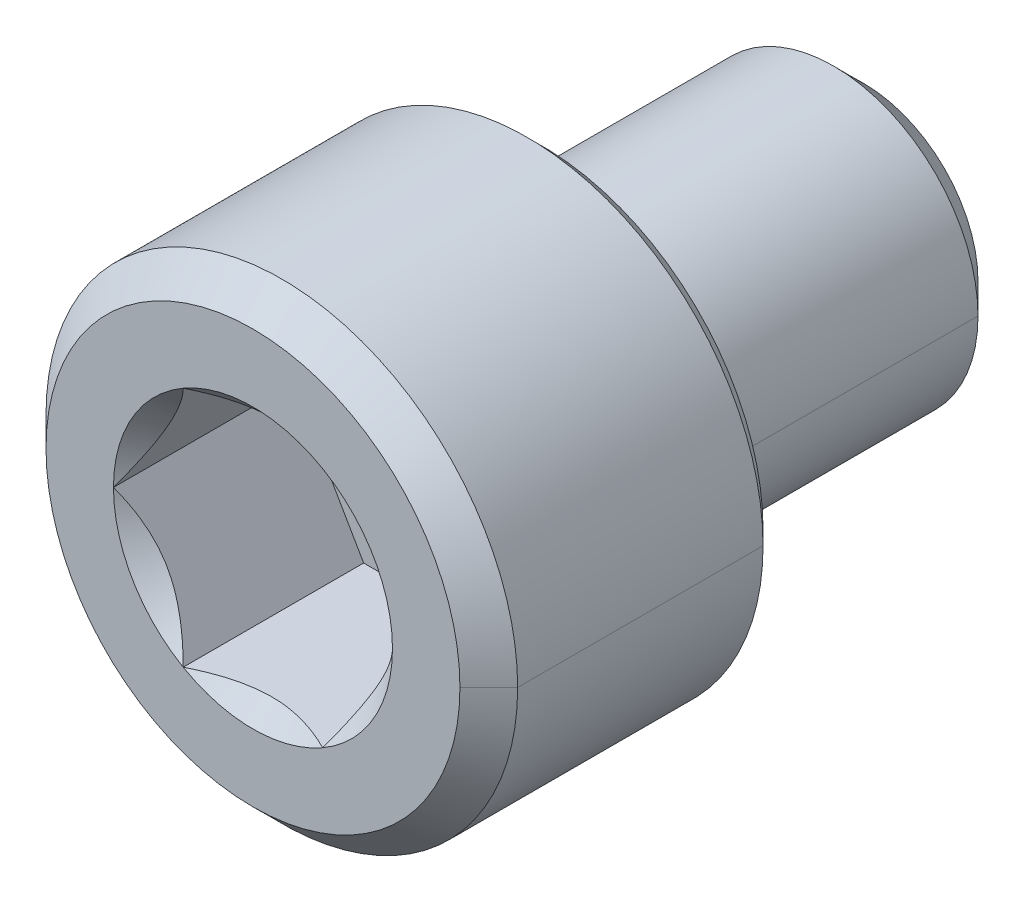
ISO-10303-21;
HEADER;
FILE_DESCRIPTION(('STEP AP214'),'2;1');
FILE_NAME('part.step','',(''),(''),'','','');
FILE_SCHEMA(('AUTOMOTIVE_DESIGN { 1 0 10303 214 1 1 1 1 }'));
ENDSEC;
DATA;
#1=APPLICATION_CONTEXT('core data for automotive mechanical design processes');
#2=APPLICATION_PROTOCOL_DEFINITION('international standard','automotive_design',2000,#1);
#3=PRODUCT_CONTEXT('',#1,'mechanical');
#4=PRODUCT('Part','Part','',(#3));
#5=PRODUCT_RELATED_PRODUCT_CATEGORY('part','',(#4));
#6=PRODUCT_DEFINITION_FORMATION('','',#4);
#7=PRODUCT_DEFINITION_CONTEXT('part definition',#1,'design');
#8=PRODUCT_DEFINITION('design','',#6,#7);
#9=PRODUCT_DEFINITION_SHAPE('','',#8);
#10=(LENGTH_UNIT() NAMED_UNIT(*) SI_UNIT(.MILLI.,.METRE.));
#11=(NAMED_UNIT(*) PLANE_ANGLE_UNIT() SI_UNIT($,.RADIAN.));
#12=(NAMED_UNIT(*) SI_UNIT($,.STERADIAN.) SOLID_ANGLE_UNIT());
#13=UNCERTAINTY_MEASURE_WITH_UNIT(LENGTH_MEASURE(1.E-05),#10,'distance_accuracy_value','');
#14=(GEOMETRIC_REPRESENTATION_CONTEXT(3) GLOBAL_UNCERTAINTY_ASSIGNED_CONTEXT((#13)) GLOBAL_UNIT_ASSIGNED_CONTEXT((#10,
#11,#12)) REPRESENTATION_CONTEXT('',''));
#15=CARTESIAN_POINT('',(0.,0.,0.));
#16=DIRECTION('',(0.,0.,1.));
#17=DIRECTION('',(1.,0.,0.));
#18=AXIS2_PLACEMENT_3D('',#15,#16,#17);
#19=CARTESIAN_POINT('',(0.,0.,3.31724));
#20=DIRECTION('',(0.,0.,1.));
#21=DIRECTION('',(1.,0.,0.));
#22=AXIS2_PLACEMENT_3D('',#19,#20,#21);
#23=CONICAL_SURFACE('',#22,2.3241,0.785398163397447);
#24=CARTESIAN_POINT('',(0.,0.,3.175));
#25=DIRECTION('',(0.,0.,-1.));
#26=DIRECTION('',(1.,0.,0.));
#27=AXIS2_PLACEMENT_3D('',#24,#25,#26);
#28=CIRCLE('',#27,2.18186);
#29=CARTESIAN_POINT('',(-2.18185999999994,0.,3.175));
#30=VERTEX_POINT('',#29);
#31=CARTESIAN_POINT('',(2.18186000000005,0.,3.175));
#32=VERTEX_POINT('',#31);
#33=EDGE_CURVE('E43',#30,#32,#28,.T.);
#34=ORIENTED_EDGE('',*,*,#33,.F.);
#35=DIRECTION('',(-0.707106781186547,0.,0.707106781186548));
#36=VECTOR('',#35,1.);
#37=CARTESIAN_POINT('',(-2.32409999999994,0.,3.31724));
#38=LINE('',#37,#36);
#39=CARTESIAN_POINT('',(-2.32409999999994,0.,3.31724));
#40=VERTEX_POINT('',#39);
#41=EDGE_CURVE('E11',#30,#40,#38,.T.);
#42=ORIENTED_EDGE('',*,*,#41,.T.);
#43=CARTESIAN_POINT('',(0.,0.,3.31724));
#44=DIRECTION('',(0.,0.,1.));
#45=DIRECTION('',(1.,0.,0.));
#46=AXIS2_PLACEMENT_3D('',#43,#44,#45);
#47=CIRCLE('',#46,2.3241);
#48=CARTESIAN_POINT('',(2.32410000000006,0.,3.31724));
#49=VERTEX_POINT('',#48);
#50=EDGE_CURVE('E319',#49,#40,#47,.T.);
#51=ORIENTED_EDGE('',*,*,#50,.F.);
#52=DIRECTION('',(0.707106781186547,0.,0.707106781186548));
#53=VECTOR('',#52,1.);
#54=CARTESIAN_POINT('',(2.32410000000006,0.,3.31724));
#55=LINE('',#54,#53);
#56=EDGE_CURVE('E189',#32,#49,#55,.T.);
#57=ORIENTED_EDGE('',*,*,#56,.F.);
#58=EDGE_LOOP('',(#34,#42,#51,#57));
#59=FACE_BOUND('',#58,.T.);
#60=ADVANCED_FACE('F16',(#59),#23,.T.);
#61=CARTESIAN_POINT('',(0.,0.,6.0198));
#62=DIRECTION('',(0.,0.,-1.));
#63=DIRECTION('',(-1.,0.,0.));
#64=AXIS2_PLACEMENT_3D('',#61,#62,#63);
#65=CONICAL_SURFACE('',#64,2.03962,0.785398163397445);
#66=CARTESIAN_POINT('',(0.,0.,6.0198));
#67=DIRECTION('',(0.,0.,1.));
#68=DIRECTION('',(1.,0.,0.));
#69=AXIS2_PLACEMENT_3D('',#66,#67,#68);
#70=CIRCLE('',#69,2.03962);
#71=CARTESIAN_POINT('',(2.03962000000006,0.,6.0198));
#72=VERTEX_POINT('',#71);
#73=CARTESIAN_POINT('',(-2.03961999999994,0.,6.0198));
#74=VERTEX_POINT('',#73);
#75=EDGE_CURVE('E307',#72,#74,#70,.T.);
#76=ORIENTED_EDGE('',*,*,#75,.F.);
#77=DIRECTION('',(0.707106781186545,0.,-0.70710678118655));
#78=VECTOR('',#77,1.);
#79=CARTESIAN_POINT('',(2.03962000000005,0.,6.0198));
#80=LINE('',#79,#78);
#81=CARTESIAN_POINT('',(2.32410000000006,0.,5.73532));
#82=VERTEX_POINT('',#81);
#83=EDGE_CURVE('E29',#72,#82,#80,.T.);
#84=ORIENTED_EDGE('',*,*,#83,.T.);
#85=CARTESIAN_POINT('',(0.,0.,5.73532));
#86=DIRECTION('',(0.,0.,-1.));
#87=DIRECTION('',(1.,0.,0.));
#88=AXIS2_PLACEMENT_3D('',#85,#86,#87);
#89=CIRCLE('',#88,2.3241);
#90=CARTESIAN_POINT('',(-2.32409999999994,0.,5.73532));
#91=VERTEX_POINT('',#90);
#92=EDGE_CURVE('E289',#91,#82,#89,.T.);
#93=ORIENTED_EDGE('',*,*,#92,.F.);
#94=DIRECTION('',(-0.707106781186545,0.,-0.70710678118655));
#95=VECTOR('',#94,1.);
#96=CARTESIAN_POINT('',(-2.03961999999994,0.,6.0198));
#97=LINE('',#96,#95);
#98=EDGE_CURVE('E303',#74,#91,#97,.T.);
#99=ORIENTED_EDGE('',*,*,#98,.F.);
#100=EDGE_LOOP('',(#76,#84,#93,#99));
#101=FACE_BOUND('',#100,.T.);
#102=ADVANCED_FACE('F250',(#101),#65,.T.);
#103=CARTESIAN_POINT('',(0.,0.,6.0198));
#104=DIRECTION('',(0.,0.,-1.));
#105=DIRECTION('',(-1.,0.,0.));
#106=AXIS2_PLACEMENT_3D('',#103,#104,#105);
#107=CYLINDRICAL_SURFACE('',#106,2.3241);
#108=ORIENTED_EDGE('',*,*,#92,.T.);
#109=DIRECTION('',(0.,0.,-1.));
#110=VECTOR('',#109,1.);
#111=CARTESIAN_POINT('',(2.32410000000006,0.,6.0198));
#112=LINE('',#111,#110);
#113=EDGE_CURVE('E293',#82,#49,#112,.T.);
#114=ORIENTED_EDGE('',*,*,#113,.T.);
#115=ORIENTED_EDGE('',*,*,#50,.T.);
#116=DIRECTION('',(0.,0.,-1.));
#117=VECTOR('',#116,1.);
#118=CARTESIAN_POINT('',(-2.32409999999994,0.,6.0198));
#119=LINE('',#118,#117);
#120=EDGE_CURVE('E294',#91,#40,#119,.T.);
#121=ORIENTED_EDGE('',*,*,#120,.F.);
#122=EDGE_LOOP('',(#108,#114,#115,#121));
#123=FACE_BOUND('',#122,.T.);
#124=ADVANCED_FACE('F271',(#123),#107,.T.);
#125=CARTESIAN_POINT('',(0.,0.,0.297179999999987));
#126=DIRECTION('',(0.,0.,1.));
#127=DIRECTION('',(1.,0.,0.));
#128=AXIS2_PLACEMENT_3D('',#125,#126,#127);
#129=CONICAL_SURFACE('',#128,1.4224,0.78539816339745);
#130=CARTESIAN_POINT('',(0.,0.,0.));
#131=DIRECTION('',(0.,0.,-1.));
#132=DIRECTION('',(1.,0.,0.));
#133=AXIS2_PLACEMENT_3D('',#130,#131,#132);
#134=CIRCLE('',#133,1.12522);
#135=CARTESIAN_POINT('',(-1.12522,0.,0.));
#136=VERTEX_POINT('',#135);
#137=CARTESIAN_POINT('',(1.12522,0.,0.));
#138=VERTEX_POINT('',#137);
#139=EDGE_CURVE('E315',#136,#138,#134,.T.);
#140=ORIENTED_EDGE('',*,*,#139,.F.);
#141=DIRECTION('',(-0.70710678118655,0.,0.707106781186546));
#142=VECTOR('',#141,1.);
#143=CARTESIAN_POINT('',(-1.42240000000003,0.,0.297179999999987));
#144=LINE('',#143,#142);
#145=CARTESIAN_POINT('',(-1.42240000000003,0.,0.297179999999987));
#146=VERTEX_POINT('',#145);
#147=EDGE_CURVE('E323',#136,#146,#144,.T.);
#148=ORIENTED_EDGE('',*,*,#147,.T.);
#149=CARTESIAN_POINT('',(0.,0.,0.297179999999987));
#150=DIRECTION('',(0.,0.,1.));
#151=DIRECTION('',(1.,0.,0.));
#152=AXIS2_PLACEMENT_3D('',#149,#150,#151);
#153=CIRCLE('',#152,1.4224);
#154=CARTESIAN_POINT('',(1.42239999999997,0.,0.297179999999987));
#155=VERTEX_POINT('',#154);
#156=EDGE_CURVE('E329',#155,#146,#153,.T.);
#157=ORIENTED_EDGE('',*,*,#156,.F.);
#158=DIRECTION('',(0.70710678118655,0.,0.707106781186546));
#159=VECTOR('',#158,1.);
#160=CARTESIAN_POINT('',(1.42239999999997,0.,0.297179999999987));
#161=LINE('',#160,#159);
#162=EDGE_CURVE('E312',#138,#155,#161,.T.);
#163=ORIENTED_EDGE('',*,*,#162,.F.);
#164=EDGE_LOOP('',(#140,#148,#157,#163));
#165=FACE_BOUND('',#164,.T.);
#166=ADVANCED_FACE('F276',(#165),#129,.T.);
#167=CARTESIAN_POINT('',(0.,0.,3.175));
#168=DIRECTION('',(0.,0.,-1.));
#169=DIRECTION('',(-1.,0.,0.));
#170=AXIS2_PLACEMENT_3D('',#167,#168,#169);
#171=CYLINDRICAL_SURFACE('',#170,1.4224);
#172=CARTESIAN_POINT('',(0.,0.,3.175));
#173=DIRECTION('',(0.,0.,1.));
#174=DIRECTION('',(1.,0.,0.));
#175=AXIS2_PLACEMENT_3D('',#172,#173,#174);
#176=CIRCLE('',#175,1.4224);
#177=CARTESIAN_POINT('',(1.42240000000006,0.,3.175));
#178=VERTEX_POINT('',#177);
#179=CARTESIAN_POINT('',(-1.42239999999994,0.,3.175));
#180=VERTEX_POINT('',#179);
#181=EDGE_CURVE('E299',#178,#180,#176,.T.);
#182=ORIENTED_EDGE('',*,*,#181,.F.);
#183=DIRECTION('',(0.,0.,-1.));
#184=VECTOR('',#183,1.);
#185=CARTESIAN_POINT('',(1.42240000000006,0.,3.175));
#186=LINE('',#185,#184);
#187=EDGE_CURVE('E333',#178,#155,#186,.T.);
#188=ORIENTED_EDGE('',*,*,#187,.T.);
#189=ORIENTED_EDGE('',*,*,#156,.T.);
#190=DIRECTION('',(0.,0.,-1.));
#191=VECTOR('',#190,1.);
#192=CARTESIAN_POINT('',(-1.42239999999994,0.,3.175));
#193=LINE('',#192,#191);
#194=EDGE_CURVE('E334',#180,#146,#193,.T.);
#195=ORIENTED_EDGE('',*,*,#194,.F.);
#196=EDGE_LOOP('',(#182,#188,#189,#195));
#197=FACE_BOUND('',#196,.T.);
#198=ADVANCED_FACE('F255',(#197),#171,.T.);
#199=CARTESIAN_POINT('',(0.,0.,3.175));
#200=DIRECTION('',(0.,0.,-1.));
#201=DIRECTION('',(-1.,0.,0.));
#202=AXIS2_PLACEMENT_3D('',#199,#200,#201);
#203=CYLINDRICAL_SURFACE('',#202,1.4224);
#204=ORIENTED_EDGE('',*,*,#187,.F.);
#205=CARTESIAN_POINT('',(0.,0.,3.175));
#206=DIRECTION('',(0.,0.,1.));
#207=DIRECTION('',(1.,0.,0.));
#208=AXIS2_PLACEMENT_3D('',#205,#206,#207);
#209=CIRCLE('',#208,1.4224);
#210=EDGE_CURVE('E302',#180,#178,#209,.T.);
#211=ORIENTED_EDGE('',*,*,#210,.F.);
#212=ORIENTED_EDGE('',*,*,#194,.T.);
#213=CARTESIAN_POINT('',(0.,0.,0.297179999999987));
#214=DIRECTION('',(0.,0.,1.));
#215=DIRECTION('',(1.,0.,0.));
#216=AXIS2_PLACEMENT_3D('',#213,#214,#215);
#217=CIRCLE('',#216,1.4224);
#218=EDGE_CURVE('E341',#146,#155,#217,.T.);
#219=ORIENTED_EDGE('',*,*,#218,.T.);
#220=EDGE_LOOP('',(#204,#211,#212,#219));
#221=FACE_BOUND('',#220,.T.);
#222=ADVANCED_FACE('F251',(#221),#203,.T.);
#223=CARTESIAN_POINT('',(0.,0.,0.));
#224=DIRECTION('',(0.,0.,1.));
#225=DIRECTION('',(1.,0.,0.));
#226=AXIS2_PLACEMENT_3D('',#223,#224,#225);
#227=PLANE('',#226);
#228=CARTESIAN_POINT('',(0.,0.,0.));
#229=DIRECTION('',(0.,0.,-1.));
#230=DIRECTION('',(1.,0.,0.));
#231=AXIS2_PLACEMENT_3D('',#228,#229,#230);
#232=CIRCLE('',#231,1.12522);
#233=EDGE_CURVE('E345',#138,#136,#232,.T.);
#234=ORIENTED_EDGE('',*,*,#233,.T.);
#235=ORIENTED_EDGE('',*,*,#139,.T.);
#236=EDGE_LOOP('',(#234,#235));
#237=FACE_BOUND('',#236,.T.);
#238=ADVANCED_FACE('F254',(#237),#227,.F.);
#239=CARTESIAN_POINT('',(0.,0.,0.297179999999987));
#240=DIRECTION('',(0.,0.,1.));
#241=DIRECTION('',(1.,0.,0.));
#242=AXIS2_PLACEMENT_3D('',#239,#240,#241);
#243=CONICAL_SURFACE('',#242,1.4224,0.78539816339745);
#244=ORIENTED_EDGE('',*,*,#147,.F.);
#245=ORIENTED_EDGE('',*,*,#233,.F.);
#246=ORIENTED_EDGE('',*,*,#162,.T.);
#247=ORIENTED_EDGE('',*,*,#218,.F.);
#248=EDGE_LOOP('',(#244,#245,#246,#247));
#249=FACE_BOUND('',#248,.T.);
#250=ADVANCED_FACE('F257',(#249),#243,.T.);
#251=CARTESIAN_POINT('',(0.,0.,6.0198));
#252=DIRECTION('',(0.,0.,-1.));
#253=DIRECTION('',(-1.,0.,0.));
#254=AXIS2_PLACEMENT_3D('',#251,#252,#253);
#255=CYLINDRICAL_SURFACE('',#254,2.3241);
#256=ORIENTED_EDGE('',*,*,#113,.F.);
#257=CARTESIAN_POINT('',(0.,0.,5.73532));
#258=DIRECTION('',(0.,0.,-1.));
#259=DIRECTION('',(1.,0.,0.));
#260=AXIS2_PLACEMENT_3D('',#257,#258,#259);
#261=CIRCLE('',#260,2.3241);
#262=EDGE_CURVE('E296',#82,#91,#261,.T.);
#263=ORIENTED_EDGE('',*,*,#262,.T.);
#264=ORIENTED_EDGE('',*,*,#120,.T.);
#265=CARTESIAN_POINT('',(0.,0.,3.31724));
#266=DIRECTION('',(0.,0.,1.));
#267=DIRECTION('',(1.,0.,0.));
#268=AXIS2_PLACEMENT_3D('',#265,#266,#267);
#269=CIRCLE('',#268,2.3241);
#270=EDGE_CURVE('E297',#40,#49,#269,.T.);
#271=ORIENTED_EDGE('',*,*,#270,.T.);
#272=EDGE_LOOP('',(#256,#263,#264,#271));
#273=FACE_BOUND('',#272,.T.);
#274=ADVANCED_FACE('F260',(#273),#255,.T.);
#275=CARTESIAN_POINT('',(0.,0.,6.0198));
#276=DIRECTION('',(0.,0.,1.));
#277=DIRECTION('',(1.,0.,0.));
#278=AXIS2_PLACEMENT_3D('',#275,#276,#277);
#279=PLANE('',#278);
#280=CARTESIAN_POINT('',(0.,0.,6.0198));
#281=DIRECTION('',(0.,0.,1.));
#282=DIRECTION('',(1.,0.,0.));
#283=AXIS2_PLACEMENT_3D('',#280,#281,#282);
#284=CIRCLE('',#283,2.03962);
#285=EDGE_CURVE('E304',#74,#72,#284,.T.);
#286=ORIENTED_EDGE('',*,*,#285,.T.);
#287=ORIENTED_EDGE('',*,*,#75,.T.);
#288=EDGE_LOOP('',(#286,#287));
#289=FACE_BOUND('',#288,.T.);
#290=CARTESIAN_POINT('',(0.,0.,6.0198));
#291=DIRECTION('',(0.,0.,1.));
#292=DIRECTION('',(1.,0.,0.));
#293=AXIS2_PLACEMENT_3D('',#290,#291,#292);
#294=CIRCLE('',#293,1.3748153285078);
#295=CARTESIAN_POINT('',(1.37481532850781,0.,6.0198));
#296=VERTEX_POINT('',#295);
#297=CARTESIAN_POINT('',(0.687407664253933,1.190625,6.0198));
#298=VERTEX_POINT('',#297);
#299=EDGE_CURVE('E165',#296,#298,#294,.T.);
#300=ORIENTED_EDGE('',*,*,#299,.F.);
#301=CARTESIAN_POINT('',(0.,0.,6.0198));
#302=DIRECTION('',(0.,0.,1.));
#303=DIRECTION('',(1.,0.,0.));
#304=AXIS2_PLACEMENT_3D('',#301,#302,#303);
#305=CIRCLE('',#304,1.3748153285078);
#306=CARTESIAN_POINT('',(0.687407664253904,-1.19062500000004,6.0198));
#307=VERTEX_POINT('',#306);
#308=EDGE_CURVE('E176',#307,#296,#305,.T.);
#309=ORIENTED_EDGE('',*,*,#308,.F.);
#310=CARTESIAN_POINT('',(0.,0.,6.0198));
#311=DIRECTION('',(0.,0.,1.));
#312=DIRECTION('',(1.,0.,0.));
#313=AXIS2_PLACEMENT_3D('',#310,#311,#312);
#314=CIRCLE('',#313,1.3748153285078);
#315=CARTESIAN_POINT('',(-0.687407664253901,-1.19062500000004,6.0198));
#316=VERTEX_POINT('',#315);
#317=EDGE_CURVE('E181',#316,#307,#314,.T.);
#318=ORIENTED_EDGE('',*,*,#317,.F.);
#319=CARTESIAN_POINT('',(0.,0.,6.0198));
#320=DIRECTION('',(0.,0.,1.));
#321=DIRECTION('',(1.,0.,0.));
#322=AXIS2_PLACEMENT_3D('',#319,#320,#321);
#323=CIRCLE('',#322,1.3748153285078);
#324=CARTESIAN_POINT('',(-1.3748153285078,0.,6.0198));
#325=VERTEX_POINT('',#324);
#326=EDGE_CURVE('E441',#325,#316,#323,.T.);
#327=ORIENTED_EDGE('',*,*,#326,.F.);
#328=CARTESIAN_POINT('',(0.,0.,6.0198));
#329=DIRECTION('',(0.,0.,1.));
#330=DIRECTION('',(1.,0.,0.));
#331=AXIS2_PLACEMENT_3D('',#328,#329,#330);
#332=CIRCLE('',#331,1.3748153285078);
#333=CARTESIAN_POINT('',(-0.687407664253846,1.19062499999995,6.0198));
#334=VERTEX_POINT('',#333);
#335=EDGE_CURVE('E211',#334,#325,#332,.T.);
#336=ORIENTED_EDGE('',*,*,#335,.F.);
#337=CARTESIAN_POINT('',(0.,0.,6.0198));
#338=DIRECTION('',(0.,0.,1.));
#339=DIRECTION('',(1.,0.,0.));
#340=AXIS2_PLACEMENT_3D('',#337,#338,#339);
#341=CIRCLE('',#340,1.3748153285078);
#342=EDGE_CURVE('E187',#298,#334,#341,.T.);
#343=ORIENTED_EDGE('',*,*,#342,.F.);
#344=EDGE_LOOP('',(#300,#309,#318,#327,#336,#343));
#345=FACE_BOUND('',#344,.T.);
#346=ADVANCED_FACE('F184',(#289,#345),#279,.T.);
#347=CARTESIAN_POINT('',(0.,0.,3.175));
#348=DIRECTION('',(0.,0.,1.));
#349=DIRECTION('',(1.,0.,0.));
#350=AXIS2_PLACEMENT_3D('',#347,#348,#349);
#351=PLANE('',#350);
#352=CARTESIAN_POINT('',(0.,0.,3.175));
#353=DIRECTION('',(0.,0.,-1.));
#354=DIRECTION('',(1.,0.,0.));
#355=AXIS2_PLACEMENT_3D('',#352,#353,#354);
#356=CIRCLE('',#355,2.18186);
#357=EDGE_CURVE('E311',#32,#30,#356,.T.);
#358=ORIENTED_EDGE('',*,*,#357,.T.);
#359=ORIENTED_EDGE('',*,*,#33,.T.);
#360=EDGE_LOOP('',(#358,#359));
#361=FACE_BOUND('',#360,.T.);
#362=ORIENTED_EDGE('',*,*,#210,.T.);
#363=ORIENTED_EDGE('',*,*,#181,.T.);
#364=EDGE_LOOP('',(#362,#363));
#365=FACE_BOUND('',#364,.T.);
#366=ADVANCED_FACE('F246',(#361,#365),#351,.F.);
#367=CARTESIAN_POINT('',(0.,0.,6.0198));
#368=DIRECTION('',(0.,0.,-1.));
#369=DIRECTION('',(-1.,0.,0.));
#370=AXIS2_PLACEMENT_3D('',#367,#368,#369);
#371=CONICAL_SURFACE('',#370,2.03962,0.785398163397445);
#372=ORIENTED_EDGE('',*,*,#83,.F.);
#373=ORIENTED_EDGE('',*,*,#285,.F.);
#374=ORIENTED_EDGE('',*,*,#98,.T.);
#375=ORIENTED_EDGE('',*,*,#262,.F.);
#376=EDGE_LOOP('',(#372,#373,#374,#375));
#377=FACE_BOUND('',#376,.T.);
#378=ADVANCED_FACE('F242',(#377),#371,.T.);
#379=CARTESIAN_POINT('',(0.,0.,3.31724));
#380=DIRECTION('',(0.,0.,1.));
#381=DIRECTION('',(1.,0.,0.));
#382=AXIS2_PLACEMENT_3D('',#379,#380,#381);
#383=CONICAL_SURFACE('',#382,2.3241,0.785398163397447);
#384=ORIENTED_EDGE('',*,*,#41,.F.);
#385=ORIENTED_EDGE('',*,*,#357,.F.);
#386=ORIENTED_EDGE('',*,*,#56,.T.);
#387=ORIENTED_EDGE('',*,*,#270,.F.);
#388=EDGE_LOOP('',(#384,#385,#386,#387));
#389=FACE_BOUND('',#388,.T.);
#390=ADVANCED_FACE('F245',(#389),#383,.T.);
#391=CARTESIAN_POINT('',(0.,0.,6.0198));
#392=DIRECTION('',(0.,0.,1.));
#393=DIRECTION('',(1.,0.,0.));
#394=AXIS2_PLACEMENT_3D('',#391,#392,#393);
#395=CONICAL_SURFACE('',#394,1.3748153285078,0.78539816339745);
#396=ORIENTED_EDGE('',*,*,#299,.T.);
#397=CARTESIAN_POINT('',(1.37481532850783,0.,6.01979999999998));
#398=CARTESIAN_POINT('',(1.19144837194481,0.317600885196405,5.83643304343693));
#399=CARTESIAN_POINT('',(1.03237789197668,0.593119038485572,5.83561236546548));
#400=CARTESIAN_POINT('',(0.87242055225413,0.870173277928591,5.83478711199852));
#401=CARTESIAN_POINT('',(0.687407664253924,1.190625,6.0198));
#402=B_SPLINE_CURVE_WITH_KNOTS('',2,(#397,#398,#399,#400,#401),.UNSPECIFIED.,.F.,.F.,(3,2,3),
(0.,0.5,1.),.UNSPECIFIED.);
#403=EDGE_CURVE('E161',#296,#298,#402,.T.);
#404=ORIENTED_EDGE('',*,*,#403,.F.);
#405=EDGE_LOOP('',(#396,#404));
#406=FACE_BOUND('',#405,.T.);
#407=ADVANCED_FACE('F163',(#406),#395,.F.);
#408=CARTESIAN_POINT('',(0.,0.,6.0198));
#409=DIRECTION('',(0.,0.,1.));
#410=DIRECTION('',(1.,0.,0.));
#411=AXIS2_PLACEMENT_3D('',#408,#409,#410);
#412=CONICAL_SURFACE('',#411,1.3748153285078,0.78539816339745);
#413=ORIENTED_EDGE('',*,*,#342,.T.);
#414=CARTESIAN_POINT('',(0.687407664253932,1.19062499999997,6.0198));
#415=CARTESIAN_POINT('',(0.319345316631335,1.19062499999997,5.83576882618874));
#416=CARTESIAN_POINT('',(7.49469000844646E-05,1.19062499999997,5.8356096738511));
#417=CARTESIAN_POINT('',(-0.318709192040755,1.19062499999997,5.83545076389351));
#418=CARTESIAN_POINT('',(-0.687407664253844,1.19062499999997,6.0198));
#419=B_SPLINE_CURVE_WITH_KNOTS('',2,(#414,#415,#416,#417,#418),.UNSPECIFIED.,.F.,.F.,(3,2,3),
(0.,0.5,1.),.UNSPECIFIED.);
#420=EDGE_CURVE('E216',#298,#334,#419,.T.);
#421=ORIENTED_EDGE('',*,*,#420,.F.);
#422=EDGE_LOOP('',(#413,#421));
#423=FACE_BOUND('',#422,.T.);
#424=ADVANCED_FACE('F508',(#423),#412,.F.);
#425=CARTESIAN_POINT('',(0.,0.,6.0198));
#426=DIRECTION('',(0.,0.,1.));
#427=DIRECTION('',(1.,0.,0.));
#428=AXIS2_PLACEMENT_3D('',#425,#426,#427);
#429=CONICAL_SURFACE('',#428,1.3748153285078,0.78539816339745);
#430=ORIENTED_EDGE('',*,*,#335,.T.);
#431=CARTESIAN_POINT('',(-0.687407664253837,1.19062499999994,6.0198));
#432=CARTESIAN_POINT('',(-0.870774620817403,0.873024114802569,5.8364330434364));
#433=CARTESIAN_POINT('',(-1.02984510078497,0.597505961514372,5.83561236546548));
#434=CARTESIAN_POINT('',(-1.1898024405081,0.320451722070359,5.83478711199906));
#435=CARTESIAN_POINT('',(-1.37481532850775,0.,6.0198));
#436=B_SPLINE_CURVE_WITH_KNOTS('',2,(#431,#432,#433,#434,#435),.UNSPECIFIED.,.F.,.F.,(3,2,3),
(0.,0.5,1.),.UNSPECIFIED.);
#437=EDGE_CURVE('E389',#334,#325,#436,.T.);
#438=ORIENTED_EDGE('',*,*,#437,.F.);
#439=EDGE_LOOP('',(#430,#438));
#440=FACE_BOUND('',#439,.T.);
#441=ADVANCED_FACE('F239',(#440),#429,.F.);
#442=CARTESIAN_POINT('',(0.,0.,6.0198));
#443=DIRECTION('',(0.,0.,1.));
#444=DIRECTION('',(1.,0.,0.));
#445=AXIS2_PLACEMENT_3D('',#442,#443,#444);
#446=CONICAL_SURFACE('',#445,1.3748153285078,0.78539816339745);
#447=ORIENTED_EDGE('',*,*,#326,.T.);
#448=CARTESIAN_POINT('',(-1.37481532850777,0.,6.0198));
#449=CARTESIAN_POINT('',(-1.19144837194439,-0.317600885197095,5.83643304343669));
#450=CARTESIAN_POINT('',(-1.03237789197663,-0.593119038485613,5.83561236546551));
#451=CARTESIAN_POINT('',(-0.872420552253757,-0.870173277929187,5.83478711199883));
#452=CARTESIAN_POINT('',(-0.687407664253877,-1.19062500000003,6.0198));
#453=B_SPLINE_CURVE_WITH_KNOTS('',2,(#448,#449,#450,#451,#452),.UNSPECIFIED.,.F.,.F.,(3,2,3),
(0.,0.5,1.),.UNSPECIFIED.);
#454=EDGE_CURVE('E448',#325,#316,#453,.T.);
#455=ORIENTED_EDGE('',*,*,#454,.F.);
#456=EDGE_LOOP('',(#447,#455));
#457=FACE_BOUND('',#456,.T.);
#458=ADVANCED_FACE('F423',(#457),#446,.F.);
#459=CARTESIAN_POINT('',(0.,0.,6.0198));
#460=DIRECTION('',(0.,0.,1.));
#461=DIRECTION('',(1.,0.,0.));
#462=AXIS2_PLACEMENT_3D('',#459,#460,#461);
#463=CONICAL_SURFACE('',#462,1.3748153285078,0.78539816339745);
#464=ORIENTED_EDGE('',*,*,#317,.T.);
#465=CARTESIAN_POINT('',(-0.687407664253901,-1.19062500000001,6.0198));
#466=CARTESIAN_POINT('',(-0.319275943761443,-1.19062500000001,5.83573413975374));
#467=CARTESIAN_POINT('',(7.49469000950898E-05,-1.19062500000001,5.83560967385102));
#468=CARTESIAN_POINT('',(0.318778584680041,-1.19062500000001,5.83548546021288));
#469=CARTESIAN_POINT('',(0.687407664253903,-1.19062500000001,6.0198));
#470=B_SPLINE_CURVE_WITH_KNOTS('',2,(#465,#466,#467,#468,#469),.UNSPECIFIED.,.F.,.F.,(3,2,3),
(0.,0.5,1.),.UNSPECIFIED.);
#471=EDGE_CURVE('E449',#316,#307,#470,.T.);
#472=ORIENTED_EDGE('',*,*,#471,.F.);
#473=EDGE_LOOP('',(#464,#472));
#474=FACE_BOUND('',#473,.T.);
#475=ADVANCED_FACE('F426',(#474),#463,.F.);
#476=CARTESIAN_POINT('',(0.,0.,6.0198));
#477=DIRECTION('',(0.,0.,1.));
#478=DIRECTION('',(1.,0.,0.));
#479=AXIS2_PLACEMENT_3D('',#476,#477,#478);
#480=CONICAL_SURFACE('',#479,1.3748153285078,0.78539816339745);
#481=ORIENTED_EDGE('',*,*,#308,.T.);
#482=CARTESIAN_POINT('',(0.68740766425391,-1.19062500000005,6.0198));
#483=CARTESIAN_POINT('',(0.87077462081693,-0.873024114803619,5.8364330434369));
#484=CARTESIAN_POINT('',(1.02984510078505,-0.597505961514459,5.83561236546545));
#485=CARTESIAN_POINT('',(1.18980244050766,-0.320451722071345,5.83478711199851));
#486=CARTESIAN_POINT('',(1.37481532850782,0.,6.0198));
#487=B_SPLINE_CURVE_WITH_KNOTS('',2,(#482,#483,#484,#485,#486),.UNSPECIFIED.,.F.,.F.,(3,2,3),
(0.,0.5,1.),.UNSPECIFIED.);
#488=EDGE_CURVE('E143',#307,#296,#487,.T.);
#489=ORIENTED_EDGE('',*,*,#488,.F.);
#490=EDGE_LOOP('',(#481,#489));
#491=FACE_BOUND('',#490,.T.);
#492=ADVANCED_FACE('F18',(#491),#480,.F.);
#493=CARTESIAN_POINT('',(0.,0.,4.2418));
#494=DIRECTION('',(0.,0.,1.));
#495=DIRECTION('',(1.,0.,0.));
#496=AXIS2_PLACEMENT_3D('',#493,#494,#495);
#497=PLANE('',#496);
#498=DIRECTION('',(0.5,0.866025403784439,0.));
#499=VECTOR('',#498,1.);
#500=CARTESIAN_POINT('',(0.687407664253904,-1.19062500000006,4.2418));
#501=LINE('',#500,#499);
#502=CARTESIAN_POINT('',(0.687407664253904,-1.19062500000006,4.2418));
#503=VERTEX_POINT('',#502);
#504=CARTESIAN_POINT('',(1.37481532850784,0.,4.2418));
#505=VERTEX_POINT('',#504);
#506=EDGE_CURVE('E182',#503,#505,#501,.T.);
#507=ORIENTED_EDGE('',*,*,#506,.T.);
#508=DIRECTION('',(-0.5,0.866025403784439,0.));
#509=VECTOR('',#508,1.);
#510=CARTESIAN_POINT('',(1.37481532850784,0.,4.2418));
#511=LINE('',#510,#509);
#512=CARTESIAN_POINT('',(0.687407664253934,1.19062499999997,4.2418));
#513=VERTEX_POINT('',#512);
#514=EDGE_CURVE('E193',#505,#513,#511,.T.);
#515=ORIENTED_EDGE('',*,*,#514,.T.);
#516=DIRECTION('',(-1.,0.,0.));
#517=VECTOR('',#516,1.);
#518=CARTESIAN_POINT('',(0.687407664253934,1.19062499999997,4.2418));
#519=LINE('',#518,#517);
#520=CARTESIAN_POINT('',(-0.687407664253818,1.19062499999997,4.2418));
#521=VERTEX_POINT('',#520);
#522=EDGE_CURVE('E288',#513,#521,#519,.T.);
#523=ORIENTED_EDGE('',*,*,#522,.T.);
#524=DIRECTION('',(-0.5,-0.866025403784439,0.));
#525=VECTOR('',#524,1.);
#526=CARTESIAN_POINT('',(-0.687407664253818,1.19062499999997,4.2418));
#527=LINE('',#526,#525);
#528=CARTESIAN_POINT('',(-1.37481532850778,0.,4.2418));
#529=VERTEX_POINT('',#528);
#530=EDGE_CURVE('E355',#521,#529,#527,.T.);
#531=ORIENTED_EDGE('',*,*,#530,.T.);
#532=DIRECTION('',(0.5,-0.866025403784439,0.));
#533=VECTOR('',#532,1.);
#534=CARTESIAN_POINT('',(-1.37481532850778,0.,4.2418));
#535=LINE('',#534,#533);
#536=CARTESIAN_POINT('',(-0.687407664253929,-1.19062500000001,4.2418));
#537=VERTEX_POINT('',#536);
#538=EDGE_CURVE('E202',#529,#537,#535,.T.);
#539=ORIENTED_EDGE('',*,*,#538,.T.);
#540=DIRECTION('',(1.,0.,0.));
#541=VECTOR('',#540,1.);
#542=CARTESIAN_POINT('',(-0.687407664253929,-1.19062500000001,4.2418));
#543=LINE('',#542,#541);
#544=EDGE_CURVE('E196',#537,#503,#543,.T.);
#545=ORIENTED_EDGE('',*,*,#544,.T.);
#546=EDGE_LOOP('',(#507,#515,#523,#531,#539,#545));
#547=FACE_BOUND('',#546,.T.);
#548=ADVANCED_FACE('F265',(#547),#497,.T.);
#549=CARTESIAN_POINT('',(1.37481532850784,0.,4.2418));
#550=DIRECTION('',(0.866025403784439,0.5,0.));
#551=DIRECTION('',(0.,0.,-1.));
#552=AXIS2_PLACEMENT_3D('',#549,#550,#551);
#553=PLANE('',#552);
#554=DIRECTION('',(0.,0.,1.));
#555=VECTOR('',#554,1.);
#556=CARTESIAN_POINT('',(1.37481532850784,0.,4.2418));
#557=LINE('',#556,#555);
#558=EDGE_CURVE('E149',#505,#296,#557,.T.);
#559=ORIENTED_EDGE('',*,*,#558,.T.);
#560=ORIENTED_EDGE('',*,*,#403,.T.);
#561=DIRECTION('',(0.,0.,1.));
#562=VECTOR('',#561,1.);
#563=CARTESIAN_POINT('',(0.687407664253934,1.19062499999997,4.2418));
#564=LINE('',#563,#562);
#565=EDGE_CURVE('E172',#513,#298,#564,.T.);
#566=ORIENTED_EDGE('',*,*,#565,.F.);
#567=ORIENTED_EDGE('',*,*,#514,.F.);
#568=EDGE_LOOP('',(#559,#560,#566,#567));
#569=FACE_BOUND('',#568,.T.);
#570=ADVANCED_FACE('F191',(#569),#553,.F.);
#571=CARTESIAN_POINT('',(0.687407664253934,1.19062499999997,4.2418));
#572=DIRECTION('',(0.,1.,0.));
#573=DIRECTION('',(1.,0.,0.));
#574=AXIS2_PLACEMENT_3D('',#571,#572,#573);
#575=PLANE('',#574);
#576=ORIENTED_EDGE('',*,*,#565,.T.);
#577=ORIENTED_EDGE('',*,*,#420,.T.);
#578=DIRECTION('',(0.,0.,1.));
#579=VECTOR('',#578,1.);
#580=CARTESIAN_POINT('',(-0.687407664253818,1.19062499999997,4.2418));
#581=LINE('',#580,#579);
#582=EDGE_CURVE('E385',#521,#334,#581,.T.);
#583=ORIENTED_EDGE('',*,*,#582,.F.);
#584=ORIENTED_EDGE('',*,*,#522,.F.);
#585=EDGE_LOOP('',(#576,#577,#583,#584));
#586=FACE_BOUND('',#585,.T.);
#587=ADVANCED_FACE('F228',(#586),#575,.F.);
#588=CARTESIAN_POINT('',(-0.687407664253818,1.19062499999997,4.2418));
#589=DIRECTION('',(-0.866025403784439,0.5,0.));
#590=DIRECTION('',(0.,0.,1.));
#591=AXIS2_PLACEMENT_3D('',#588,#589,#590);
#592=PLANE('',#591);
#593=ORIENTED_EDGE('',*,*,#582,.T.);
#594=ORIENTED_EDGE('',*,*,#437,.T.);
#595=DIRECTION('',(0.,0.,1.));
#596=VECTOR('',#595,1.);
#597=CARTESIAN_POINT('',(-1.37481532850778,0.,4.2418));
#598=LINE('',#597,#596);
#599=EDGE_CURVE('E395',#529,#325,#598,.T.);
#600=ORIENTED_EDGE('',*,*,#599,.F.);
#601=ORIENTED_EDGE('',*,*,#530,.F.);
#602=EDGE_LOOP('',(#593,#594,#600,#601));
#603=FACE_BOUND('',#602,.T.);
#604=ADVANCED_FACE('F238',(#603),#592,.F.);
#605=CARTESIAN_POINT('',(-1.37481532850778,0.,4.2418));
#606=DIRECTION('',(-0.866025403784439,-0.5,0.));
#607=DIRECTION('',(-0.5,0.866025403784439,0.));
#608=AXIS2_PLACEMENT_3D('',#605,#606,#607);
#609=PLANE('',#608);
#610=ORIENTED_EDGE('',*,*,#599,.T.);
#611=ORIENTED_EDGE('',*,*,#454,.T.);
#612=DIRECTION('',(0.,0.,1.));
#613=VECTOR('',#612,1.);
#614=CARTESIAN_POINT('',(-0.687407664253929,-1.19062500000001,4.2418));
#615=LINE('',#614,#613);
#616=EDGE_CURVE('E444',#537,#316,#615,.T.);
#617=ORIENTED_EDGE('',*,*,#616,.F.);
#618=ORIENTED_EDGE('',*,*,#538,.F.);
#619=EDGE_LOOP('',(#610,#611,#617,#618));
#620=FACE_BOUND('',#619,.T.);
#621=ADVANCED_FACE('F418',(#620),#609,.F.);
#622=CARTESIAN_POINT('',(-0.687407664253929,-1.19062500000001,4.2418));
#623=DIRECTION('',(0.,-1.,0.));
#624=DIRECTION('',(0.,0.,-1.));
#625=AXIS2_PLACEMENT_3D('',#622,#623,#624);
#626=PLANE('',#625);
#627=ORIENTED_EDGE('',*,*,#616,.T.);
#628=ORIENTED_EDGE('',*,*,#471,.T.);
#629=DIRECTION('',(0.,0.,1.));
#630=VECTOR('',#629,1.);
#631=CARTESIAN_POINT('',(0.687407664253904,-1.19062500000006,4.2418));
#632=LINE('',#631,#630);
#633=EDGE_CURVE('E151',#503,#307,#632,.T.);
#634=ORIENTED_EDGE('',*,*,#633,.F.);
#635=ORIENTED_EDGE('',*,*,#544,.F.);
#636=EDGE_LOOP('',(#627,#628,#634,#635));
#637=FACE_BOUND('',#636,.T.);
#638=ADVANCED_FACE('F458',(#637),#626,.F.);
#639=CARTESIAN_POINT('',(0.687407664253904,-1.19062500000006,4.2418));
#640=DIRECTION('',(0.866025403784439,-0.5,0.));
#641=DIRECTION('',(0.,0.,-1.));
#642=AXIS2_PLACEMENT_3D('',#639,#640,#641);
#643=PLANE('',#642);
#644=ORIENTED_EDGE('',*,*,#633,.T.);
#645=ORIENTED_EDGE('',*,*,#488,.T.);
#646=ORIENTED_EDGE('',*,*,#558,.F.);
#647=ORIENTED_EDGE('',*,*,#506,.F.);
#648=EDGE_LOOP('',(#644,#645,#646,#647));
#649=FACE_BOUND('',#648,.T.);
#650=ADVANCED_FACE('F146',(#649),#643,.F.);
#651=CLOSED_SHELL('',(#60,#102,#124,#166,#198,#222,#238,#250,#274,#346,#366,#378,#390,#407,#424,
#441,#458,#475,#492,#548,#570,#587,#604,#621,#638,#650));
#652=MANIFOLD_SOLID_BREP('B1',#651);
#653=ADVANCED_BREP_SHAPE_REPRESENTATION('',(#18,#652),#14);
#654=SHAPE_DEFINITION_REPRESENTATION(#9,#653);
ENDSEC;
END-ISO-10303-21;
